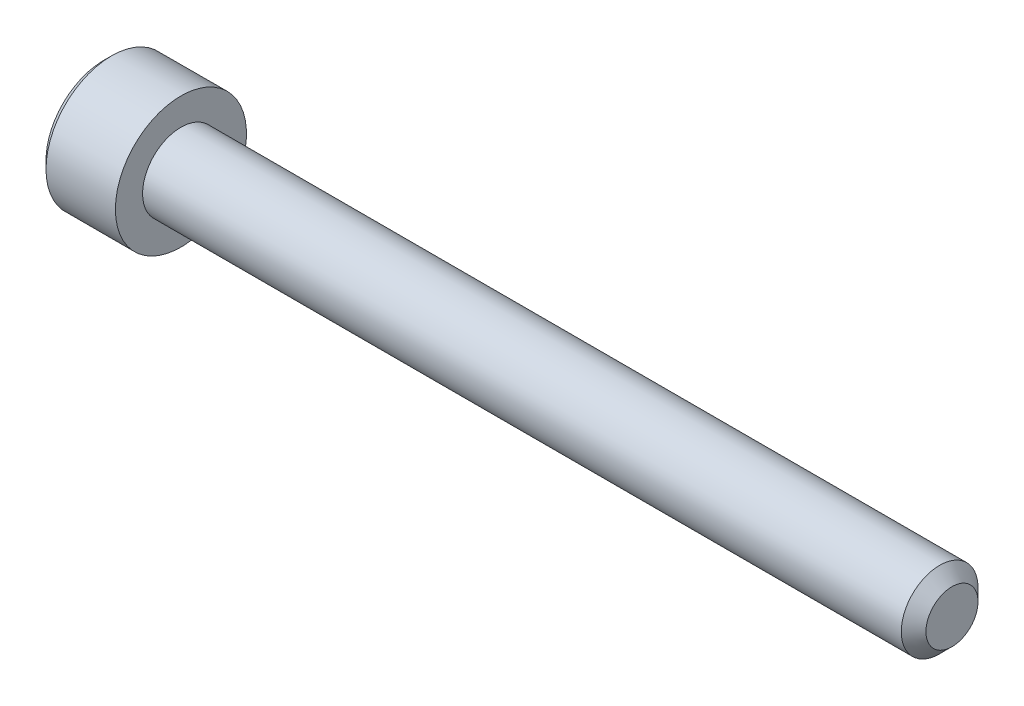
ISO-10303-21;
HEADER;
FILE_DESCRIPTION(('STEP AP214'),'2;1');
FILE_NAME('part.step','',(''),(''),'','','');
FILE_SCHEMA(('AUTOMOTIVE_DESIGN { 1 0 10303 214 1 1 1 1 }'));
ENDSEC;
DATA;
#1=APPLICATION_CONTEXT('core data for automotive mechanical design processes');
#2=APPLICATION_PROTOCOL_DEFINITION('international standard','automotive_design',2000,#1);
#3=PRODUCT_CONTEXT('',#1,'mechanical');
#4=PRODUCT('Part','Part','',(#3));
#5=PRODUCT_RELATED_PRODUCT_CATEGORY('part','',(#4));
#6=PRODUCT_DEFINITION_FORMATION('','',#4);
#7=PRODUCT_DEFINITION_CONTEXT('part definition',#1,'design');
#8=PRODUCT_DEFINITION('design','',#6,#7);
#9=PRODUCT_DEFINITION_SHAPE('','',#8);
#10=(LENGTH_UNIT() NAMED_UNIT(*) SI_UNIT(.MILLI.,.METRE.));
#11=(NAMED_UNIT(*) PLANE_ANGLE_UNIT() SI_UNIT($,.RADIAN.));
#12=(NAMED_UNIT(*) SI_UNIT($,.STERADIAN.) SOLID_ANGLE_UNIT());
#13=UNCERTAINTY_MEASURE_WITH_UNIT(LENGTH_MEASURE(1.E-05),#10,'distance_accuracy_value','');
#14=(GEOMETRIC_REPRESENTATION_CONTEXT(3) GLOBAL_UNCERTAINTY_ASSIGNED_CONTEXT((#13)) GLOBAL_UNIT_ASSIGNED_CONTEXT((#10,
#11,#12)) REPRESENTATION_CONTEXT('',''));
#15=CARTESIAN_POINT('',(0.,0.,0.));
#16=DIRECTION('',(0.,0.,1.));
#17=DIRECTION('',(1.,0.,0.));
#18=AXIS2_PLACEMENT_3D('',#15,#16,#17);
#19=CARTESIAN_POINT('',(0.,0.,0.));
#20=DIRECTION('',(1.,0.,0.));
#21=DIRECTION('',(0.,0.,-1.));
#22=AXIS2_PLACEMENT_3D('',#19,#20,#21);
#23=PLANE('',#22);
#24=DIRECTION('',(0.,0.866025403784439,0.5));
#25=VECTOR('',#24,1.);
#26=CARTESIAN_POINT('',(0.,2.2,-1.50111069989302));
#27=LINE('',#26,#25);
#28=CARTESIAN_POINT('',(0.,0.,-2.77128129211019));
#29=VERTEX_POINT('',#28);
#30=CARTESIAN_POINT('',(0.,2.39999999999999,-1.3856406460551));
#31=VERTEX_POINT('',#30);
#32=EDGE_CURVE('E156',#29,#31,#27,.T.);
#33=ORIENTED_EDGE('',*,*,#32,.T.);
#34=DIRECTION('',(0.,0.,1.));
#35=VECTOR('',#34,1.);
#36=CARTESIAN_POINT('',(0.,2.39999999999999,1.15470053837925));
#37=LINE('',#36,#35);
#38=CARTESIAN_POINT('',(0.,2.39999999999999,1.3856406460551));
#39=VERTEX_POINT('',#38);
#40=EDGE_CURVE('E166',#31,#39,#37,.T.);
#41=ORIENTED_EDGE('',*,*,#40,.T.);
#42=DIRECTION('',(0.,-0.866025403784439,0.5));
#43=VECTOR('',#42,1.);
#44=CARTESIAN_POINT('',(0.,0.199999999999996,2.65581123827227));
#45=LINE('',#44,#43);
#46=CARTESIAN_POINT('',(0.,0.,2.77128129211019));
#47=VERTEX_POINT('',#46);
#48=EDGE_CURVE('E164',#39,#47,#45,.T.);
#49=ORIENTED_EDGE('',*,*,#48,.T.);
#50=DIRECTION('',(0.,-0.866025403784439,-0.499999999999999));
#51=VECTOR('',#50,1.);
#52=CARTESIAN_POINT('',(0.,-2.2,1.50111069989302));
#53=LINE('',#52,#51);
#54=CARTESIAN_POINT('',(0.,-2.39999999999999,1.3856406460551));
#55=VERTEX_POINT('',#54);
#56=EDGE_CURVE('E162',#47,#55,#53,.T.);
#57=ORIENTED_EDGE('',*,*,#56,.T.);
#58=DIRECTION('',(0.,0.,-1.));
#59=VECTOR('',#58,1.);
#60=CARTESIAN_POINT('',(0.,-2.39999999999999,-1.15470053837925));
#61=LINE('',#60,#59);
#62=CARTESIAN_POINT('',(0.,-2.39999999999999,-1.3856406460551));
#63=VERTEX_POINT('',#62);
#64=EDGE_CURVE('E160',#55,#63,#61,.T.);
#65=ORIENTED_EDGE('',*,*,#64,.T.);
#66=DIRECTION('',(0.,0.866025403784439,-0.5));
#67=VECTOR('',#66,1.);
#68=CARTESIAN_POINT('',(0.,-0.199999999999995,-2.65581123827227));
#69=LINE('',#68,#67);
#70=EDGE_CURVE('E158',#63,#29,#69,.T.);
#71=ORIENTED_EDGE('',*,*,#70,.T.);
#72=EDGE_LOOP('',(#33,#41,#49,#57,#65,#71));
#73=FACE_BOUND('',#72,.T.);
#74=CARTESIAN_POINT('',(0.,0.,0.));
#75=DIRECTION('',(1.,0.,0.));
#76=DIRECTION('',(0.,0.,-1.));
#77=AXIS2_PLACEMENT_3D('',#74,#75,#76);
#78=CIRCLE('',#77,3.75);
#79=CARTESIAN_POINT('',(0.,0.,-3.75));
#80=VERTEX_POINT('',#79);
#81=EDGE_CURVE('E150',#80,#80,#78,.F.);
#82=ORIENTED_EDGE('',*,*,#81,.T.);
#83=EDGE_LOOP('',(#82));
#84=FACE_BOUND('',#83,.T.);
#85=ADVANCED_FACE('F35',(#73,#84),#23,.F.);
#86=CARTESIAN_POINT('',(55.,0.,0.));
#87=DIRECTION('',(-1.,0.,0.));
#88=DIRECTION('',(0.,0.,1.));
#89=AXIS2_PLACEMENT_3D('',#86,#87,#88);
#90=PLANE('',#89);
#91=CARTESIAN_POINT('',(55.,0.,0.));
#92=DIRECTION('',(-1.,0.,0.));
#93=DIRECTION('',(0.,0.,1.));
#94=AXIS2_PLACEMENT_3D('',#91,#92,#93);
#95=CIRCLE('',#94,1.688);
#96=CARTESIAN_POINT('',(55.,0.,1.688));
#97=VERTEX_POINT('',#96);
#98=EDGE_CURVE('E147',#97,#97,#95,.F.);
#99=ORIENTED_EDGE('',*,*,#98,.T.);
#100=EDGE_LOOP('',(#99));
#101=FACE_BOUND('',#100,.T.);
#102=ADVANCED_FACE('F246',(#101),#90,.F.);
#103=CARTESIAN_POINT('',(-88.7054908485857,0.,0.));
#104=DIRECTION('',(-1.,0.,0.));
#105=DIRECTION('',(0.,0.,1.));
#106=AXIS2_PLACEMENT_3D('',#103,#104,#105);
#107=CYLINDRICAL_SURFACE('',#106,2.488);
#108=CARTESIAN_POINT('',(54.2,0.,0.));
#109=DIRECTION('',(-1.,0.,0.));
#110=DIRECTION('',(0.,0.,1.));
#111=AXIS2_PLACEMENT_3D('',#108,#109,#110);
#112=CIRCLE('',#111,2.488);
#113=CARTESIAN_POINT('',(54.2,0.,2.488));
#114=VERTEX_POINT('',#113);
#115=EDGE_CURVE('E144',#114,#114,#112,.T.);
#116=ORIENTED_EDGE('',*,*,#115,.T.);
#117=EDGE_LOOP('',(#116));
#118=FACE_BOUND('',#117,.T.);
#119=CARTESIAN_POINT('',(5.,0.,0.));
#120=DIRECTION('',(-1.,0.,0.));
#121=DIRECTION('',(0.,0.,1.));
#122=AXIS2_PLACEMENT_3D('',#119,#120,#121);
#123=CIRCLE('',#122,2.488);
#124=CARTESIAN_POINT('',(5.,0.,2.488));
#125=VERTEX_POINT('',#124);
#126=EDGE_CURVE('E136',#125,#125,#123,.T.);
#127=ORIENTED_EDGE('',*,*,#126,.F.);
#128=EDGE_LOOP('',(#127));
#129=FACE_BOUND('',#128,.T.);
#130=ADVANCED_FACE('F251',(#118,#129),#107,.T.);
#131=CARTESIAN_POINT('',(5.,2.488,0.));
#132=DIRECTION('',(-1.,0.,0.));
#133=DIRECTION('',(0.,0.,1.));
#134=AXIS2_PLACEMENT_3D('',#131,#132,#133);
#135=PLANE('',#134);
#136=CARTESIAN_POINT('',(5.,0.,0.));
#137=DIRECTION('',(-1.,0.,0.));
#138=DIRECTION('',(0.,0.,1.));
#139=AXIS2_PLACEMENT_3D('',#136,#137,#138);
#140=CIRCLE('',#139,4.25);
#141=CARTESIAN_POINT('',(5.,0.,4.25));
#142=VERTEX_POINT('',#141);
#143=EDGE_CURVE('E132',#142,#142,#140,.T.);
#144=ORIENTED_EDGE('',*,*,#143,.F.);
#145=EDGE_LOOP('',(#144));
#146=FACE_BOUND('',#145,.T.);
#147=ORIENTED_EDGE('',*,*,#126,.T.);
#148=EDGE_LOOP('',(#147));
#149=FACE_BOUND('',#148,.T.);
#150=ADVANCED_FACE('F261',(#146,#149),#135,.F.);
#151=CARTESIAN_POINT('',(-88.7054908485857,0.,0.));
#152=DIRECTION('',(-1.,0.,0.));
#153=DIRECTION('',(0.,0.,1.));
#154=AXIS2_PLACEMENT_3D('',#151,#152,#153);
#155=CYLINDRICAL_SURFACE('',#154,4.25);
#156=CARTESIAN_POINT('',(0.5,0.,0.));
#157=DIRECTION('',(1.,0.,0.));
#158=DIRECTION('',(0.,0.,-1.));
#159=AXIS2_PLACEMENT_3D('',#156,#157,#158);
#160=CIRCLE('',#159,4.25);
#161=CARTESIAN_POINT('',(0.5,0.,-4.25));
#162=VERTEX_POINT('',#161);
#163=EDGE_CURVE('E153',#162,#162,#160,.T.);
#164=ORIENTED_EDGE('',*,*,#163,.T.);
#165=EDGE_LOOP('',(#164));
#166=FACE_BOUND('',#165,.T.);
#167=ORIENTED_EDGE('',*,*,#143,.T.);
#168=EDGE_LOOP('',(#167));
#169=FACE_BOUND('',#168,.T.);
#170=ADVANCED_FACE('F257',(#166,#169),#155,.T.);
#171=CARTESIAN_POINT('',(54.2,0.,0.));
#172=DIRECTION('',(-1.,0.,0.));
#173=DIRECTION('',(0.,0.,1.));
#174=AXIS2_PLACEMENT_3D('',#171,#172,#173);
#175=CONICAL_SURFACE('',#174,2.488,0.785398163397449);
#176=ORIENTED_EDGE('',*,*,#98,.F.);
#177=EDGE_LOOP('',(#176));
#178=FACE_BOUND('',#177,.T.);
#179=ORIENTED_EDGE('',*,*,#115,.F.);
#180=EDGE_LOOP('',(#179));
#181=FACE_BOUND('',#180,.T.);
#182=ADVANCED_FACE('F260',(#178,#181),#175,.T.);
#183=CARTESIAN_POINT('',(0.,0.,0.));
#184=DIRECTION('',(1.,0.,0.));
#185=DIRECTION('',(0.,0.,-1.));
#186=AXIS2_PLACEMENT_3D('',#183,#184,#185);
#187=CONICAL_SURFACE('',#186,3.75,0.785398163397445);
#188=ORIENTED_EDGE('',*,*,#163,.F.);
#189=EDGE_LOOP('',(#188));
#190=FACE_BOUND('',#189,.T.);
#191=ORIENTED_EDGE('',*,*,#81,.F.);
#192=EDGE_LOOP('',(#191));
#193=FACE_BOUND('',#192,.T.);
#194=ADVANCED_FACE('F271',(#190,#193),#187,.T.);
#195=CARTESIAN_POINT('',(2.5,2.,1.15470053837925));
#196=DIRECTION('',(0.,-0.5,-0.866025403784439));
#197=DIRECTION('',(0.,0.866025403784439,-0.5));
#198=AXIS2_PLACEMENT_3D('',#195,#196,#197);
#199=PLANE('',#198);
#200=DIRECTION('',(-1.,0.,0.));
#201=VECTOR('',#200,1.);
#202=CARTESIAN_POINT('',(2.5,0.,2.3094010767585));
#203=LINE('',#202,#201);
#204=CARTESIAN_POINT('',(2.5,0.,2.3094010767585));
#205=VERTEX_POINT('',#204);
#206=CARTESIAN_POINT('',(0.399999999999998,0.,2.3094010767585));
#207=VERTEX_POINT('',#206);
#208=EDGE_CURVE('E124',#205,#207,#203,.T.);
#209=ORIENTED_EDGE('',*,*,#208,.T.);
#210=DIRECTION('',(0.,0.866025403784439,-0.5));
#211=VECTOR('',#210,1.);
#212=CARTESIAN_POINT('',(0.399999999999998,2.,1.15470053837925));
#213=LINE('',#212,#211);
#214=CARTESIAN_POINT('',(0.399999999999998,2.,1.15470053837925));
#215=VERTEX_POINT('',#214);
#216=EDGE_CURVE('E172',#207,#215,#213,.T.);
#217=ORIENTED_EDGE('',*,*,#216,.T.);
#218=DIRECTION('',(-1.,0.,0.));
#219=VECTOR('',#218,1.);
#220=CARTESIAN_POINT('',(2.5,2.,1.15470053837925));
#221=LINE('',#220,#219);
#222=CARTESIAN_POINT('',(2.5,2.,1.15470053837925));
#223=VERTEX_POINT('',#222);
#224=EDGE_CURVE('E127',#223,#215,#221,.T.);
#225=ORIENTED_EDGE('',*,*,#224,.F.);
#226=DIRECTION('',(0.,-0.866025403784439,0.5));
#227=VECTOR('',#226,1.);
#228=CARTESIAN_POINT('',(2.5,2.,1.15470053837925));
#229=LINE('',#228,#227);
#230=EDGE_CURVE('E112',#223,#205,#229,.T.);
#231=ORIENTED_EDGE('',*,*,#230,.T.);
#232=EDGE_LOOP('',(#209,#217,#225,#231));
#233=FACE_BOUND('',#232,.T.);
#234=ADVANCED_FACE('F123',(#233),#199,.T.);
#235=CARTESIAN_POINT('',(2.5,0.,2.3094010767585));
#236=DIRECTION('',(0.,0.499999999999999,-0.866025403784439));
#237=DIRECTION('',(0.,0.866025403784439,0.499999999999999));
#238=AXIS2_PLACEMENT_3D('',#235,#236,#237);
#239=PLANE('',#238);
#240=DIRECTION('',(-1.,0.,0.));
#241=VECTOR('',#240,1.);
#242=CARTESIAN_POINT('',(2.5,-2.,1.15470053837925));
#243=LINE('',#242,#241);
#244=CARTESIAN_POINT('',(2.5,-2.,1.15470053837925));
#245=VERTEX_POINT('',#244);
#246=CARTESIAN_POINT('',(0.399999999999998,-2.,1.15470053837925));
#247=VERTEX_POINT('',#246);
#248=EDGE_CURVE('E133',#245,#247,#243,.T.);
#249=ORIENTED_EDGE('',*,*,#248,.T.);
#250=DIRECTION('',(0.,0.866025403784439,0.499999999999999));
#251=VECTOR('',#250,1.);
#252=CARTESIAN_POINT('',(0.399999999999998,0.,2.3094010767585));
#253=LINE('',#252,#251);
#254=EDGE_CURVE('E131',#247,#207,#253,.T.);
#255=ORIENTED_EDGE('',*,*,#254,.T.);
#256=ORIENTED_EDGE('',*,*,#208,.F.);
#257=DIRECTION('',(0.,-0.866025403784439,-0.499999999999999));
#258=VECTOR('',#257,1.);
#259=CARTESIAN_POINT('',(2.5,0.,2.3094010767585));
#260=LINE('',#259,#258);
#261=EDGE_CURVE('E108',#205,#245,#260,.T.);
#262=ORIENTED_EDGE('',*,*,#261,.T.);
#263=EDGE_LOOP('',(#249,#255,#256,#262));
#264=FACE_BOUND('',#263,.T.);
#265=ADVANCED_FACE('F129',(#264),#239,.T.);
#266=CARTESIAN_POINT('',(2.5,-2.,1.15470053837925));
#267=DIRECTION('',(0.,1.,0.));
#268=DIRECTION('',(0.,0.,1.));
#269=AXIS2_PLACEMENT_3D('',#266,#267,#268);
#270=PLANE('',#269);
#271=DIRECTION('',(-1.,0.,0.));
#272=VECTOR('',#271,1.);
#273=CARTESIAN_POINT('',(2.5,-2.,-1.15470053837925));
#274=LINE('',#273,#272);
#275=CARTESIAN_POINT('',(2.5,-2.,-1.15470053837925));
#276=VERTEX_POINT('',#275);
#277=CARTESIAN_POINT('',(0.399999999999998,-2.,-1.15470053837925));
#278=VERTEX_POINT('',#277);
#279=EDGE_CURVE('E138',#276,#278,#274,.T.);
#280=ORIENTED_EDGE('',*,*,#279,.T.);
#281=DIRECTION('',(0.,0.,1.));
#282=VECTOR('',#281,1.);
#283=CARTESIAN_POINT('',(0.399999999999998,-2.,1.15470053837925));
#284=LINE('',#283,#282);
#285=EDGE_CURVE('E175',#278,#247,#284,.T.);
#286=ORIENTED_EDGE('',*,*,#285,.T.);
#287=ORIENTED_EDGE('',*,*,#248,.F.);
#288=DIRECTION('',(0.,0.,-1.));
#289=VECTOR('',#288,1.);
#290=CARTESIAN_POINT('',(2.5,-2.,1.15470053837925));
#291=LINE('',#290,#289);
#292=EDGE_CURVE('E114',#245,#276,#291,.T.);
#293=ORIENTED_EDGE('',*,*,#292,.T.);
#294=EDGE_LOOP('',(#280,#286,#287,#293));
#295=FACE_BOUND('',#294,.T.);
#296=ADVANCED_FACE('F202',(#295),#270,.T.);
#297=CARTESIAN_POINT('',(2.5,-2.,-1.15470053837925));
#298=DIRECTION('',(0.,0.5,0.866025403784439));
#299=DIRECTION('',(0.,-0.866025403784439,0.5));
#300=AXIS2_PLACEMENT_3D('',#297,#298,#299);
#301=PLANE('',#300);
#302=DIRECTION('',(-1.,0.,0.));
#303=VECTOR('',#302,1.);
#304=CARTESIAN_POINT('',(2.5,0.,-2.3094010767585));
#305=LINE('',#304,#303);
#306=CARTESIAN_POINT('',(2.5,0.,-2.3094010767585));
#307=VERTEX_POINT('',#306);
#308=CARTESIAN_POINT('',(0.399999999999998,0.,-2.3094010767585));
#309=VERTEX_POINT('',#308);
#310=EDGE_CURVE('E203',#307,#309,#305,.T.);
#311=ORIENTED_EDGE('',*,*,#310,.T.);
#312=DIRECTION('',(0.,-0.866025403784439,0.5));
#313=VECTOR('',#312,1.);
#314=CARTESIAN_POINT('',(0.399999999999998,-2.,-1.15470053837925));
#315=LINE('',#314,#313);
#316=EDGE_CURVE('E44',#309,#278,#315,.T.);
#317=ORIENTED_EDGE('',*,*,#316,.T.);
#318=ORIENTED_EDGE('',*,*,#279,.F.);
#319=DIRECTION('',(0.,0.866025403784439,-0.5));
#320=VECTOR('',#319,1.);
#321=CARTESIAN_POINT('',(2.5,-2.,-1.15470053837925));
#322=LINE('',#321,#320);
#323=EDGE_CURVE('E213',#276,#307,#322,.T.);
#324=ORIENTED_EDGE('',*,*,#323,.T.);
#325=EDGE_LOOP('',(#311,#317,#318,#324));
#326=FACE_BOUND('',#325,.T.);
#327=ADVANCED_FACE('F215',(#326),#301,.T.);
#328=CARTESIAN_POINT('',(2.5,0.,-2.3094010767585));
#329=DIRECTION('',(0.,-0.5,0.866025403784439));
#330=DIRECTION('',(0.,-0.866025403784439,-0.5));
#331=AXIS2_PLACEMENT_3D('',#328,#329,#330);
#332=PLANE('',#331);
#333=DIRECTION('',(-1.,0.,0.));
#334=VECTOR('',#333,1.);
#335=CARTESIAN_POINT('',(2.5,2.,-1.15470053837925));
#336=LINE('',#335,#334);
#337=CARTESIAN_POINT('',(2.5,2.,-1.15470053837925));
#338=VERTEX_POINT('',#337);
#339=CARTESIAN_POINT('',(0.399999999999998,2.,-1.15470053837925));
#340=VERTEX_POINT('',#339);
#341=EDGE_CURVE('E204',#338,#340,#336,.T.);
#342=ORIENTED_EDGE('',*,*,#341,.T.);
#343=DIRECTION('',(0.,-0.866025403784439,-0.5));
#344=VECTOR('',#343,1.);
#345=CARTESIAN_POINT('',(0.399999999999998,0.,-2.3094010767585));
#346=LINE('',#345,#344);
#347=EDGE_CURVE('E11',#340,#309,#346,.T.);
#348=ORIENTED_EDGE('',*,*,#347,.T.);
#349=ORIENTED_EDGE('',*,*,#310,.F.);
#350=DIRECTION('',(0.,0.866025403784439,0.5));
#351=VECTOR('',#350,1.);
#352=CARTESIAN_POINT('',(2.5,0.,-2.3094010767585));
#353=LINE('',#352,#351);
#354=EDGE_CURVE('E211',#307,#338,#353,.T.);
#355=ORIENTED_EDGE('',*,*,#354,.T.);
#356=EDGE_LOOP('',(#342,#348,#349,#355));
#357=FACE_BOUND('',#356,.T.);
#358=ADVANCED_FACE('F217',(#357),#332,.T.);
#359=CARTESIAN_POINT('',(2.5,2.,-1.15470053837925));
#360=DIRECTION('',(0.,-1.,0.));
#361=DIRECTION('',(0.,0.,-1.));
#362=AXIS2_PLACEMENT_3D('',#359,#360,#361);
#363=PLANE('',#362);
#364=ORIENTED_EDGE('',*,*,#224,.T.);
#365=DIRECTION('',(0.,0.,-1.));
#366=VECTOR('',#365,1.);
#367=CARTESIAN_POINT('',(0.399999999999998,2.,-1.15470053837925));
#368=LINE('',#367,#366);
#369=EDGE_CURVE('E169',#215,#340,#368,.T.);
#370=ORIENTED_EDGE('',*,*,#369,.T.);
#371=ORIENTED_EDGE('',*,*,#341,.F.);
#372=DIRECTION('',(0.,0.,1.));
#373=VECTOR('',#372,1.);
#374=CARTESIAN_POINT('',(2.5,2.,-1.15470053837925));
#375=LINE('',#374,#373);
#376=EDGE_CURVE('E209',#338,#223,#375,.T.);
#377=ORIENTED_EDGE('',*,*,#376,.T.);
#378=EDGE_LOOP('',(#364,#370,#371,#377));
#379=FACE_BOUND('',#378,.T.);
#380=ADVANCED_FACE('F220',(#379),#363,.T.);
#381=CARTESIAN_POINT('',(2.5,0.,0.));
#382=DIRECTION('',(1.,0.,0.));
#383=DIRECTION('',(0.,0.,-1.));
#384=AXIS2_PLACEMENT_3D('',#381,#382,#383);
#385=PLANE('',#384);
#386=ORIENTED_EDGE('',*,*,#230,.F.);
#387=ORIENTED_EDGE('',*,*,#376,.F.);
#388=ORIENTED_EDGE('',*,*,#354,.F.);
#389=ORIENTED_EDGE('',*,*,#323,.F.);
#390=ORIENTED_EDGE('',*,*,#292,.F.);
#391=ORIENTED_EDGE('',*,*,#261,.F.);
#392=EDGE_LOOP('',(#386,#387,#388,#389,#390,#391));
#393=FACE_BOUND('',#392,.T.);
#394=ADVANCED_FACE('F110',(#393),#385,.F.);
#395=CARTESIAN_POINT('',(0.,-2.39999999999999,0.));
#396=DIRECTION('',(-0.707106781186542,0.707106781186553,0.));
#397=DIRECTION('',(0.,0.,1.));
#398=AXIS2_PLACEMENT_3D('',#395,#396,#397);
#399=PLANE('',#398);
#400=DIRECTION('',(0.654653670707983,0.654653670707972,-0.377964473009225));
#401=VECTOR('',#400,1.);
#402=CARTESIAN_POINT('',(0.342857142857142,-2.05714285714285,1.18769198233294));
#403=LINE('',#402,#401);
#404=EDGE_CURVE('E187',#247,#55,#403,.F.);
#405=ORIENTED_EDGE('',*,*,#404,.F.);
#406=ORIENTED_EDGE('',*,*,#285,.F.);
#407=DIRECTION('',(0.654653670707983,0.654653670707973,0.377964473009225));
#408=VECTOR('',#407,1.);
#409=CARTESIAN_POINT('',(0.342857142857143,-2.05714285714285,-1.18769198233294));
#410=LINE('',#409,#408);
#411=EDGE_CURVE('E39',#63,#278,#410,.T.);
#412=ORIENTED_EDGE('',*,*,#411,.F.);
#413=ORIENTED_EDGE('',*,*,#64,.F.);
#414=EDGE_LOOP('',(#405,#406,#412,#413));
#415=FACE_BOUND('',#414,.T.);
#416=ADVANCED_FACE('F37',(#415),#399,.T.);
#417=CARTESIAN_POINT('',(0.,-1.2,-2.07846096908264));
#418=DIRECTION('',(-0.707106781186542,0.353553390593277,0.612372435695799));
#419=DIRECTION('',(0.,-0.866025403784439,0.5));
#420=AXIS2_PLACEMENT_3D('',#417,#418,#419);
#421=PLANE('',#420);
#422=ORIENTED_EDGE('',*,*,#411,.T.);
#423=ORIENTED_EDGE('',*,*,#316,.F.);
#424=DIRECTION('',(0.654653670707983,0.,0.75592894601845));
#425=VECTOR('',#424,1.);
#426=CARTESIAN_POINT('',(0.342857142857143,0.,-2.37538396466589));
#427=LINE('',#426,#425);
#428=EDGE_CURVE('E185',#29,#309,#427,.T.);
#429=ORIENTED_EDGE('',*,*,#428,.F.);
#430=ORIENTED_EDGE('',*,*,#70,.F.);
#431=EDGE_LOOP('',(#422,#423,#429,#430));
#432=FACE_BOUND('',#431,.T.);
#433=ADVANCED_FACE('F196',(#432),#421,.T.);
#434=CARTESIAN_POINT('',(0.,-1.19999999999999,2.07846096908265));
#435=DIRECTION('',(-0.707106781186542,0.353553390593276,-0.612372435695799));
#436=DIRECTION('',(0.,0.866025403784439,0.499999999999999));
#437=AXIS2_PLACEMENT_3D('',#434,#435,#436);
#438=PLANE('',#437);
#439=ORIENTED_EDGE('',*,*,#404,.T.);
#440=ORIENTED_EDGE('',*,*,#56,.F.);
#441=DIRECTION('',(0.654653670707983,0.,-0.755928946018449));
#442=VECTOR('',#441,1.);
#443=CARTESIAN_POINT('',(0.342857142857143,0.,2.37538396466588));
#444=LINE('',#443,#442);
#445=EDGE_CURVE('E182',#207,#47,#444,.F.);
#446=ORIENTED_EDGE('',*,*,#445,.F.);
#447=ORIENTED_EDGE('',*,*,#254,.F.);
#448=EDGE_LOOP('',(#439,#440,#446,#447));
#449=FACE_BOUND('',#448,.T.);
#450=ADVANCED_FACE('F237',(#449),#438,.T.);
#451=CARTESIAN_POINT('',(0.,1.2,-2.07846096908265));
#452=DIRECTION('',(-0.707106781186542,-0.353553390593276,0.612372435695799));
#453=DIRECTION('',(0.,-0.866025403784439,-0.5));
#454=AXIS2_PLACEMENT_3D('',#451,#452,#453);
#455=PLANE('',#454);
#456=ORIENTED_EDGE('',*,*,#428,.T.);
#457=ORIENTED_EDGE('',*,*,#347,.F.);
#458=DIRECTION('',(-0.654653670707983,0.654653670707972,-0.377964473009225));
#459=VECTOR('',#458,1.);
#460=CARTESIAN_POINT('',(0.342857142857143,2.05714285714285,-1.18769198233294));
#461=LINE('',#460,#459);
#462=EDGE_CURVE('E180',#31,#340,#461,.F.);
#463=ORIENTED_EDGE('',*,*,#462,.F.);
#464=ORIENTED_EDGE('',*,*,#32,.F.);
#465=EDGE_LOOP('',(#456,#457,#463,#464));
#466=FACE_BOUND('',#465,.T.);
#467=ADVANCED_FACE('F235',(#466),#455,.T.);
#468=CARTESIAN_POINT('',(0.,1.2,2.07846096908264));
#469=DIRECTION('',(-0.707106781186542,-0.353553390593277,-0.6123724356958));
#470=DIRECTION('',(0.,0.866025403784439,-0.5));
#471=AXIS2_PLACEMENT_3D('',#468,#469,#470);
#472=PLANE('',#471);
#473=ORIENTED_EDGE('',*,*,#445,.T.);
#474=ORIENTED_EDGE('',*,*,#48,.F.);
#475=DIRECTION('',(0.654653670707983,-0.654653670707973,-0.377964473009224));
#476=VECTOR('',#475,1.);
#477=CARTESIAN_POINT('',(0.342857142857142,2.05714285714285,1.18769198233294));
#478=LINE('',#477,#476);
#479=EDGE_CURVE('E178',#215,#39,#478,.F.);
#480=ORIENTED_EDGE('',*,*,#479,.F.);
#481=ORIENTED_EDGE('',*,*,#216,.F.);
#482=EDGE_LOOP('',(#473,#474,#480,#481));
#483=FACE_BOUND('',#482,.T.);
#484=ADVANCED_FACE('F230',(#483),#472,.T.);
#485=CARTESIAN_POINT('',(0.,2.39999999999999,0.));
#486=DIRECTION('',(-0.707106781186542,-0.707106781186553,0.));
#487=DIRECTION('',(0.,0.,-1.));
#488=AXIS2_PLACEMENT_3D('',#485,#486,#487);
#489=PLANE('',#488);
#490=ORIENTED_EDGE('',*,*,#462,.T.);
#491=ORIENTED_EDGE('',*,*,#369,.F.);
#492=ORIENTED_EDGE('',*,*,#479,.T.);
#493=ORIENTED_EDGE('',*,*,#40,.F.);
#494=EDGE_LOOP('',(#490,#491,#492,#493));
#495=FACE_BOUND('',#494,.T.);
#496=ADVANCED_FACE('F224',(#495),#489,.T.);
#497=CLOSED_SHELL('',(#85,#102,#130,#150,#170,#182,#194,#234,#265,#296,#327,#358,#380,#394,#416,
#433,#450,#467,#484,#496));
#498=MANIFOLD_SOLID_BREP('B2',#497);
#499=ADVANCED_BREP_SHAPE_REPRESENTATION('',(#18,#498),#14);
#500=SHAPE_DEFINITION_REPRESENTATION(#9,#499);
ENDSEC;
END-ISO-10303-21;
